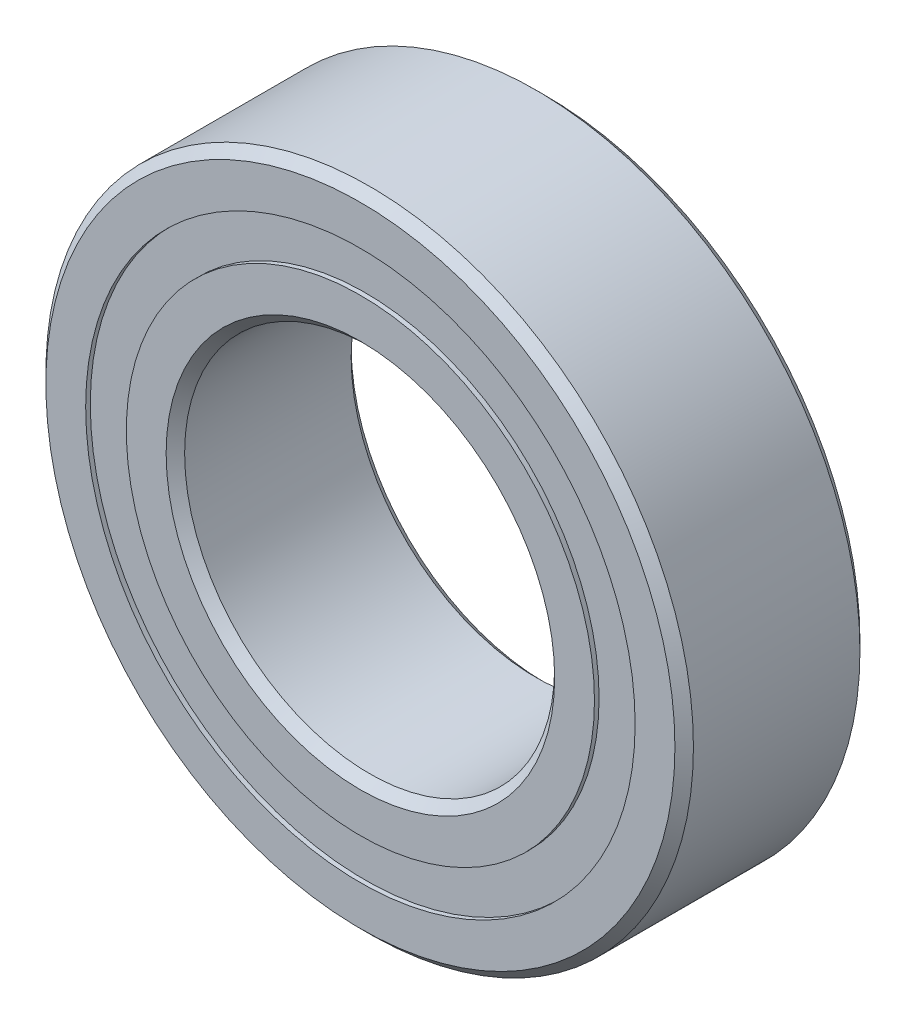
ISO-10303-21;
HEADER;
FILE_DESCRIPTION(('STEP AP214'),'2;1');
FILE_NAME('part.step','',(''),(''),'','','');
FILE_SCHEMA(('AUTOMOTIVE_DESIGN { 1 0 10303 214 1 1 1 1 }'));
ENDSEC;
DATA;
#1=APPLICATION_CONTEXT('core data for automotive mechanical design processes');
#2=APPLICATION_PROTOCOL_DEFINITION('international standard','automotive_design',2000,#1);
#3=PRODUCT_CONTEXT('',#1,'mechanical');
#4=PRODUCT('Part','Part','',(#3));
#5=PRODUCT_RELATED_PRODUCT_CATEGORY('part','',(#4));
#6=PRODUCT_DEFINITION_FORMATION('','',#4);
#7=PRODUCT_DEFINITION_CONTEXT('part definition',#1,'design');
#8=PRODUCT_DEFINITION('design','',#6,#7);
#9=PRODUCT_DEFINITION_SHAPE('','',#8);
#10=(LENGTH_UNIT() NAMED_UNIT(*) SI_UNIT(.MILLI.,.METRE.));
#11=(NAMED_UNIT(*) PLANE_ANGLE_UNIT() SI_UNIT($,.RADIAN.));
#12=(NAMED_UNIT(*) SI_UNIT($,.STERADIAN.) SOLID_ANGLE_UNIT());
#13=UNCERTAINTY_MEASURE_WITH_UNIT(LENGTH_MEASURE(1.E-05),#10,'distance_accuracy_value','');
#14=(GEOMETRIC_REPRESENTATION_CONTEXT(3) GLOBAL_UNCERTAINTY_ASSIGNED_CONTEXT((#13)) GLOBAL_UNIT_ASSIGNED_CONTEXT((#10,
#11,#12)) REPRESENTATION_CONTEXT('',''));
#15=CARTESIAN_POINT('',(0.,0.,0.));
#16=DIRECTION('',(0.,0.,1.));
#17=DIRECTION('',(1.,0.,0.));
#18=AXIS2_PLACEMENT_3D('',#15,#16,#17);
#19=CARTESIAN_POINT('',(0.,5.93956043956044,-1.9));
#20=DIRECTION('',(0.,0.,1.));
#21=DIRECTION('',(1.,0.,0.));
#22=AXIS2_PLACEMENT_3D('',#19,#20,#21);
#23=PLANE('',#22);
#24=CARTESIAN_POINT('',(0.,0.,-1.9));
#25=DIRECTION('',(0.,0.,1.));
#26=DIRECTION('',(1.,0.,0.));
#27=AXIS2_PLACEMENT_3D('',#24,#25,#26);
#28=CIRCLE('',#27,5.93956043956044);
#29=CARTESIAN_POINT('',(5.93956043956044,0.,-1.9));
#30=VERTEX_POINT('',#29);
#31=EDGE_CURVE('E64',#30,#30,#28,.T.);
#32=ORIENTED_EDGE('',*,*,#31,.F.);
#33=EDGE_LOOP('',(#32));
#34=FACE_BOUND('',#33,.T.);
#35=CARTESIAN_POINT('',(0.,0.,-1.9));
#36=DIRECTION('',(0.,0.,1.));
#37=DIRECTION('',(1.,0.,0.));
#38=AXIS2_PLACEMENT_3D('',#35,#36,#37);
#39=CIRCLE('',#38,5.06043956043956);
#40=CARTESIAN_POINT('',(5.06043956043956,0.,-1.9));
#41=VERTEX_POINT('',#40);
#42=EDGE_CURVE('E11',#41,#41,#39,.T.);
#43=ORIENTED_EDGE('',*,*,#42,.T.);
#44=EDGE_LOOP('',(#43));
#45=FACE_BOUND('',#44,.T.);
#46=ADVANCED_FACE('F50',(#34,#45),#23,.F.);
#47=CARTESIAN_POINT('',(0.,0.,2.));
#48=DIRECTION('',(0.,0.,1.));
#49=DIRECTION('',(1.,0.,0.));
#50=AXIS2_PLACEMENT_3D('',#47,#48,#49);
#51=CYLINDRICAL_SURFACE('',#50,5.06043956043956);
#52=ORIENTED_EDGE('',*,*,#42,.F.);
#53=EDGE_LOOP('',(#52));
#54=FACE_BOUND('',#53,.T.);
#55=CARTESIAN_POINT('',(0.,0.,-0.991633418565898));
#56=DIRECTION('',(0.,0.,1.));
#57=DIRECTION('',(1.,0.,0.));
#58=AXIS2_PLACEMENT_3D('',#55,#56,#57);
#59=CIRCLE('',#58,5.06043956043956);
#60=CARTESIAN_POINT('',(5.06043956043956,0.,-0.991633418565898));
#61=VERTEX_POINT('',#60);
#62=EDGE_CURVE('E56',#61,#61,#59,.T.);
#63=ORIENTED_EDGE('',*,*,#62,.T.);
#64=EDGE_LOOP('',(#63));
#65=FACE_BOUND('',#64,.T.);
#66=ADVANCED_FACE('F73',(#54,#65),#51,.F.);
#67=CARTESIAN_POINT('',(0.,5.93956043956044,-0.991633418565898));
#68=DIRECTION('',(0.,0.,-1.));
#69=DIRECTION('',(-1.,0.,0.));
#70=AXIS2_PLACEMENT_3D('',#67,#68,#69);
#71=PLANE('',#70);
#72=ORIENTED_EDGE('',*,*,#62,.F.);
#73=EDGE_LOOP('',(#72));
#74=FACE_BOUND('',#73,.T.);
#75=CARTESIAN_POINT('',(0.,0.,-0.991633418565898));
#76=DIRECTION('',(0.,0.,1.));
#77=DIRECTION('',(1.,0.,0.));
#78=AXIS2_PLACEMENT_3D('',#75,#76,#77);
#79=CIRCLE('',#78,5.93956043956044);
#80=CARTESIAN_POINT('',(5.93956043956044,0.,-0.991633418565898));
#81=VERTEX_POINT('',#80);
#82=EDGE_CURVE('E60',#81,#81,#79,.T.);
#83=ORIENTED_EDGE('',*,*,#82,.T.);
#84=EDGE_LOOP('',(#83));
#85=FACE_BOUND('',#84,.T.);
#86=ADVANCED_FACE('F77',(#74,#85),#71,.F.);
#87=CARTESIAN_POINT('',(0.,0.,2.));
#88=DIRECTION('',(0.,0.,1.));
#89=DIRECTION('',(1.,0.,0.));
#90=AXIS2_PLACEMENT_3D('',#87,#88,#89);
#91=CYLINDRICAL_SURFACE('',#90,5.93956043956044);
#92=ORIENTED_EDGE('',*,*,#82,.F.);
#93=EDGE_LOOP('',(#92));
#94=FACE_BOUND('',#93,.T.);
#95=ORIENTED_EDGE('',*,*,#31,.T.);
#96=EDGE_LOOP('',(#95));
#97=FACE_BOUND('',#96,.T.);
#98=ADVANCED_FACE('F70',(#94,#97),#91,.T.);
#99=CLOSED_SHELL('',(#46,#66,#86,#98));
#100=MANIFOLD_SOLID_BREP('B2',#99);
#101=CARTESIAN_POINT('',(0.,5.93956043956044,1.9));
#102=DIRECTION('',(0.,0.,-1.));
#103=DIRECTION('',(-1.,0.,0.));
#104=AXIS2_PLACEMENT_3D('',#101,#102,#103);
#105=PLANE('',#104);
#106=CARTESIAN_POINT('',(0.,0.,1.9));
#107=DIRECTION('',(0.,0.,1.));
#108=DIRECTION('',(1.,0.,0.));
#109=AXIS2_PLACEMENT_3D('',#106,#107,#108);
#110=CIRCLE('',#109,5.06043956043956);
#111=CARTESIAN_POINT('',(5.06043956043956,0.,1.9));
#112=VERTEX_POINT('',#111);
#113=EDGE_CURVE('E49',#112,#112,#110,.T.);
#114=ORIENTED_EDGE('',*,*,#113,.F.);
#115=EDGE_LOOP('',(#114));
#116=FACE_BOUND('',#115,.T.);
#117=CARTESIAN_POINT('',(0.,0.,1.9));
#118=DIRECTION('',(0.,0.,1.));
#119=DIRECTION('',(1.,0.,0.));
#120=AXIS2_PLACEMENT_3D('',#117,#118,#119);
#121=CIRCLE('',#120,5.93956043956044);
#122=CARTESIAN_POINT('',(5.93956043956044,0.,1.9));
#123=VERTEX_POINT('',#122);
#124=EDGE_CURVE('E124',#123,#123,#121,.T.);
#125=ORIENTED_EDGE('',*,*,#124,.T.);
#126=EDGE_LOOP('',(#125));
#127=FACE_BOUND('',#126,.T.);
#128=ADVANCED_FACE('F110',(#116,#127),#105,.F.);
#129=CARTESIAN_POINT('',(0.,0.,2.));
#130=DIRECTION('',(0.,0.,1.));
#131=DIRECTION('',(1.,0.,0.));
#132=AXIS2_PLACEMENT_3D('',#129,#130,#131);
#133=CYLINDRICAL_SURFACE('',#132,5.06043956043956);
#134=CARTESIAN_POINT('',(0.,0.,0.991633418565898));
#135=DIRECTION('',(0.,0.,1.));
#136=DIRECTION('',(1.,0.,0.));
#137=AXIS2_PLACEMENT_3D('',#134,#135,#136);
#138=CIRCLE('',#137,5.06043956043956);
#139=CARTESIAN_POINT('',(5.06043956043956,0.,0.991633418565898));
#140=VERTEX_POINT('',#139);
#141=EDGE_CURVE('E116',#140,#140,#138,.T.);
#142=ORIENTED_EDGE('',*,*,#141,.F.);
#143=EDGE_LOOP('',(#142));
#144=FACE_BOUND('',#143,.T.);
#145=ORIENTED_EDGE('',*,*,#113,.T.);
#146=EDGE_LOOP('',(#145));
#147=FACE_BOUND('',#146,.T.);
#148=ADVANCED_FACE('F139',(#144,#147),#133,.F.);
#149=CARTESIAN_POINT('',(0.,5.93956043956044,0.991633418565898));
#150=DIRECTION('',(0.,0.,1.));
#151=DIRECTION('',(1.,0.,0.));
#152=AXIS2_PLACEMENT_3D('',#149,#150,#151);
#153=PLANE('',#152);
#154=CARTESIAN_POINT('',(0.,0.,0.991633418565898));
#155=DIRECTION('',(0.,0.,1.));
#156=DIRECTION('',(1.,0.,0.));
#157=AXIS2_PLACEMENT_3D('',#154,#155,#156);
#158=CIRCLE('',#157,5.93956043956044);
#159=CARTESIAN_POINT('',(5.93956043956044,0.,0.991633418565898));
#160=VERTEX_POINT('',#159);
#161=EDGE_CURVE('E120',#160,#160,#158,.T.);
#162=ORIENTED_EDGE('',*,*,#161,.F.);
#163=EDGE_LOOP('',(#162));
#164=FACE_BOUND('',#163,.T.);
#165=ORIENTED_EDGE('',*,*,#141,.T.);
#166=EDGE_LOOP('',(#165));
#167=FACE_BOUND('',#166,.T.);
#168=ADVANCED_FACE('F134',(#164,#167),#153,.F.);
#169=CARTESIAN_POINT('',(0.,0.,2.));
#170=DIRECTION('',(0.,0.,1.));
#171=DIRECTION('',(1.,0.,0.));
#172=AXIS2_PLACEMENT_3D('',#169,#170,#171);
#173=CYLINDRICAL_SURFACE('',#172,5.93956043956044);
#174=ORIENTED_EDGE('',*,*,#124,.F.);
#175=EDGE_LOOP('',(#174));
#176=FACE_BOUND('',#175,.T.);
#177=ORIENTED_EDGE('',*,*,#161,.T.);
#178=EDGE_LOOP('',(#177));
#179=FACE_BOUND('',#178,.T.);
#180=ADVANCED_FACE('F131',(#176,#179),#173,.T.);
#181=CLOSED_SHELL('',(#128,#148,#168,#180));
#182=MANIFOLD_SOLID_BREP('B6',#181);
#183=CARTESIAN_POINT('',(-2.74999999999994,4.76313972081445,0.));
#184=DIRECTION('',(0.,0.,1.));
#185=DIRECTION('',(-0.499999999999989,0.866025403784445,0.));
#186=AXIS2_PLACEMENT_3D('',#183,#184,#185);
#187=SPHERICAL_SURFACE('',#186,0.991633418565898);
#188=CARTESIAN_POINT('',(-2.74999999999994,4.76313972081445,0.991633418565898));
#189=VERTEX_POINT('',#188);
#190=VERTEX_LOOP('',#189);
#191=FACE_BOUND('',#190,.T.);
#192=ADVANCED_FACE('F170',(#191),#187,.T.);
#193=CLOSED_SHELL('',(#192));
#194=MANIFOLD_SOLID_BREP('B44',#193);
#195=CARTESIAN_POINT('',(-4.76313972081438,2.75000000000006,0.));
#196=DIRECTION('',(0.,0.,1.));
#197=DIRECTION('',(-0.866025403784433,0.50000000000001,0.));
#198=AXIS2_PLACEMENT_3D('',#195,#196,#197);
#199=SPHERICAL_SURFACE('',#198,0.991633418565898);
#200=CARTESIAN_POINT('',(-4.76313972081438,2.75000000000006,0.991633418565898));
#201=VERTEX_POINT('',#200);
#202=VERTEX_LOOP('',#201);
#203=FACE_BOUND('',#202,.T.);
#204=ADVANCED_FACE('F193',(#203),#199,.T.);
#205=CLOSED_SHELL('',(#204));
#206=MANIFOLD_SOLID_BREP('B106',#205);
#207=CARTESIAN_POINT('',(-5.5,0.,0.));
#208=DIRECTION('',(0.,0.,1.));
#209=DIRECTION('',(-1.,0.,0.));
#210=AXIS2_PLACEMENT_3D('',#207,#208,#209);
#211=SPHERICAL_SURFACE('',#210,0.991633418565898);
#212=CARTESIAN_POINT('',(-5.5,0.,0.991633418565898));
#213=VERTEX_POINT('',#212);
#214=VERTEX_LOOP('',#213);
#215=FACE_BOUND('',#214,.T.);
#216=ADVANCED_FACE('F216',(#215),#211,.T.);
#217=CLOSED_SHELL('',(#216));
#218=MANIFOLD_SOLID_BREP('B166',#217);
#219=CARTESIAN_POINT('',(-4.76313972081444,-2.74999999999996,0.));
#220=DIRECTION('',(0.,0.,1.));
#221=DIRECTION('',(-0.866025403784443,-0.499999999999992,0.));
#222=AXIS2_PLACEMENT_3D('',#219,#220,#221);
#223=SPHERICAL_SURFACE('',#222,0.991633418565898);
#224=CARTESIAN_POINT('',(-4.76313972081444,-2.74999999999996,0.991633418565898));
#225=VERTEX_POINT('',#224);
#226=VERTEX_LOOP('',#225);
#227=FACE_BOUND('',#226,.T.);
#228=ADVANCED_FACE('F239',(#227),#223,.T.);
#229=CLOSED_SHELL('',(#228));
#230=MANIFOLD_SOLID_BREP('B189',#229);
#231=CARTESIAN_POINT('',(-2.75000000000004,-4.76313972081439,0.));
#232=DIRECTION('',(0.,0.,1.));
#233=DIRECTION('',(-0.500000000000007,-0.866025403784435,0.));
#234=AXIS2_PLACEMENT_3D('',#231,#232,#233);
#235=SPHERICAL_SURFACE('',#234,0.991633418565898);
#236=CARTESIAN_POINT('',(-2.75000000000004,-4.76313972081439,0.991633418565898));
#237=VERTEX_POINT('',#236);
#238=VERTEX_LOOP('',#237);
#239=FACE_BOUND('',#238,.T.);
#240=ADVANCED_FACE('F262',(#239),#235,.T.);
#241=CLOSED_SHELL('',(#240));
#242=MANIFOLD_SOLID_BREP('B212',#241);
#243=CARTESIAN_POINT('',(0.,-5.5,0.));
#244=DIRECTION('',(0.,0.,1.));
#245=DIRECTION('',(0.,-1.,0.));
#246=AXIS2_PLACEMENT_3D('',#243,#244,#245);
#247=SPHERICAL_SURFACE('',#246,0.991633418565898);
#248=CARTESIAN_POINT('',(0.,-5.5,0.991633418565898));
#249=VERTEX_POINT('',#248);
#250=VERTEX_LOOP('',#249);
#251=FACE_BOUND('',#250,.T.);
#252=ADVANCED_FACE('F285',(#251),#247,.T.);
#253=CLOSED_SHELL('',(#252));
#254=MANIFOLD_SOLID_BREP('B235',#253);
#255=CARTESIAN_POINT('',(2.74999999999997,-4.76313972081443,0.));
#256=DIRECTION('',(0.,0.,1.));
#257=DIRECTION('',(0.499999999999995,-0.866025403784442,0.));
#258=AXIS2_PLACEMENT_3D('',#255,#256,#257);
#259=SPHERICAL_SURFACE('',#258,0.991633418565898);
#260=CARTESIAN_POINT('',(2.74999999999997,-4.76313972081443,0.991633418565898));
#261=VERTEX_POINT('',#260);
#262=VERTEX_LOOP('',#261);
#263=FACE_BOUND('',#262,.T.);
#264=ADVANCED_FACE('F308',(#263),#259,.T.);
#265=CLOSED_SHELL('',(#264));
#266=MANIFOLD_SOLID_BREP('B258',#265);
#267=CARTESIAN_POINT('',(4.7631397208144,-2.75000000000002,0.));
#268=DIRECTION('',(0.,0.,1.));
#269=DIRECTION('',(0.866025403784436,-0.500000000000004,0.));
#270=AXIS2_PLACEMENT_3D('',#267,#268,#269);
#271=SPHERICAL_SURFACE('',#270,0.991633418565898);
#272=CARTESIAN_POINT('',(4.7631397208144,-2.75000000000002,0.991633418565898));
#273=VERTEX_POINT('',#272);
#274=VERTEX_LOOP('',#273);
#275=FACE_BOUND('',#274,.T.);
#276=ADVANCED_FACE('F331',(#275),#271,.T.);
#277=CLOSED_SHELL('',(#276));
#278=MANIFOLD_SOLID_BREP('B281',#277);
#279=CARTESIAN_POINT('',(5.5,0.,0.));
#280=DIRECTION('',(0.,0.,1.));
#281=DIRECTION('',(1.,0.,0.));
#282=AXIS2_PLACEMENT_3D('',#279,#280,#281);
#283=SPHERICAL_SURFACE('',#282,0.991633418565898);
#284=CARTESIAN_POINT('',(5.5,0.,0.991633418565898));
#285=VERTEX_POINT('',#284);
#286=VERTEX_LOOP('',#285);
#287=FACE_BOUND('',#286,.T.);
#288=ADVANCED_FACE('F354',(#287),#283,.T.);
#289=CLOSED_SHELL('',(#288));
#290=MANIFOLD_SOLID_BREP('B304',#289);
#291=CARTESIAN_POINT('',(4.76313972081442,2.74999999999999,0.));
#292=DIRECTION('',(0.,0.,1.));
#293=DIRECTION('',(0.86602540378444,0.499999999999998,0.));
#294=AXIS2_PLACEMENT_3D('',#291,#292,#293);
#295=SPHERICAL_SURFACE('',#294,0.991633418565898);
#296=CARTESIAN_POINT('',(4.76313972081442,2.74999999999999,0.991633418565898));
#297=VERTEX_POINT('',#296);
#298=VERTEX_LOOP('',#297);
#299=FACE_BOUND('',#298,.T.);
#300=ADVANCED_FACE('F377',(#299),#295,.T.);
#301=CLOSED_SHELL('',(#300));
#302=MANIFOLD_SOLID_BREP('B327',#301);
#303=CARTESIAN_POINT('',(2.75000000000001,4.76313972081441,0.));
#304=DIRECTION('',(0.,0.,1.));
#305=DIRECTION('',(0.500000000000001,0.866025403784438,0.));
#306=AXIS2_PLACEMENT_3D('',#303,#304,#305);
#307=SPHERICAL_SURFACE('',#306,0.991633418565898);
#308=CARTESIAN_POINT('',(2.75000000000001,4.76313972081441,0.991633418565898));
#309=VERTEX_POINT('',#308);
#310=VERTEX_LOOP('',#309);
#311=FACE_BOUND('',#310,.T.);
#312=ADVANCED_FACE('F400',(#311),#307,.T.);
#313=CLOSED_SHELL('',(#312));
#314=MANIFOLD_SOLID_BREP('B350',#313);
#315=CARTESIAN_POINT('',(0.,5.5,0.));
#316=DIRECTION('',(0.,0.,1.));
#317=DIRECTION('',(0.,1.,0.));
#318=AXIS2_PLACEMENT_3D('',#315,#316,#317);
#319=SPHERICAL_SURFACE('',#318,0.991633418565898);
#320=CARTESIAN_POINT('',(0.,5.5,0.991633418565898));
#321=VERTEX_POINT('',#320);
#322=VERTEX_LOOP('',#321);
#323=FACE_BOUND('',#322,.T.);
#324=ADVANCED_FACE('F425',(#323),#319,.T.);
#325=CLOSED_SHELL('',(#324));
#326=MANIFOLD_SOLID_BREP('B373',#325);
#327=CARTESIAN_POINT('',(0.,5.06043956043956,2.));
#328=DIRECTION('',(0.,0.,-1.));
#329=DIRECTION('',(-1.,0.,0.));
#330=AXIS2_PLACEMENT_3D('',#327,#328,#329);
#331=PLANE('',#330);
#332=CARTESIAN_POINT('',(0.,0.,2.));
#333=DIRECTION('',(0.,0.,1.));
#334=DIRECTION('',(1.,0.,0.));
#335=AXIS2_PLACEMENT_3D('',#332,#333,#334);
#336=CIRCLE('',#335,4.2);
#337=CARTESIAN_POINT('',(4.2,0.,2.));
#338=VERTEX_POINT('',#337);
#339=EDGE_CURVE('E471',#338,#338,#336,.T.);
#340=ORIENTED_EDGE('',*,*,#339,.F.);
#341=EDGE_LOOP('',(#340));
#342=FACE_BOUND('',#341,.T.);
#343=CARTESIAN_POINT('',(0.,0.,2.));
#344=DIRECTION('',(0.,0.,1.));
#345=DIRECTION('',(1.,0.,0.));
#346=AXIS2_PLACEMENT_3D('',#343,#344,#345);
#347=CIRCLE('',#346,5.06043956043956);
#348=CARTESIAN_POINT('',(5.06043956043956,0.,2.));
#349=VERTEX_POINT('',#348);
#350=EDGE_CURVE('E424',#349,#349,#347,.T.);
#351=ORIENTED_EDGE('',*,*,#350,.T.);
#352=EDGE_LOOP('',(#351));
#353=FACE_BOUND('',#352,.T.);
#354=ADVANCED_FACE('F443',(#342,#353),#331,.F.);
#355=CARTESIAN_POINT('',(0.,0.,2.));
#356=DIRECTION('',(0.,0.,1.));
#357=DIRECTION('',(1.,0.,0.));
#358=AXIS2_PLACEMENT_3D('',#355,#356,#357);
#359=CYLINDRICAL_SURFACE('',#358,5.06043956043956);
#360=ORIENTED_EDGE('',*,*,#350,.F.);
#361=EDGE_LOOP('',(#360));
#362=FACE_BOUND('',#361,.T.);
#363=CARTESIAN_POINT('',(0.,0.,0.888888888888889));
#364=DIRECTION('',(0.,0.,1.));
#365=DIRECTION('',(1.,0.,0.));
#366=AXIS2_PLACEMENT_3D('',#363,#364,#365);
#367=CIRCLE('',#366,5.06043956043956);
#368=CARTESIAN_POINT('',(5.06043956043956,0.,0.888888888888889));
#369=VERTEX_POINT('',#368);
#370=EDGE_CURVE('E449',#369,#369,#367,.T.);
#371=ORIENTED_EDGE('',*,*,#370,.T.);
#372=EDGE_LOOP('',(#371));
#373=FACE_BOUND('',#372,.T.);
#374=ADVANCED_FACE('F478',(#362,#373),#359,.T.);
#375=CARTESIAN_POINT('',(0.,0.,0.));
#376=DIRECTION('',(0.,0.,1.));
#377=DIRECTION('',(1.,0.,0.));
#378=AXIS2_PLACEMENT_3D('',#375,#376,#377);
#379=TOROIDAL_SURFACE('',#378,5.5,0.991633418565897);
#380=ORIENTED_EDGE('',*,*,#370,.F.);
#381=EDGE_LOOP('',(#380));
#382=FACE_BOUND('',#381,.T.);
#383=CARTESIAN_POINT('',(0.,0.,-0.88888888888889));
#384=DIRECTION('',(0.,0.,1.));
#385=DIRECTION('',(1.,0.,0.));
#386=AXIS2_PLACEMENT_3D('',#383,#384,#385);
#387=CIRCLE('',#386,5.06043956043956);
#388=CARTESIAN_POINT('',(5.06043956043956,0.,-0.88888888888889));
#389=VERTEX_POINT('',#388);
#390=EDGE_CURVE('E453',#389,#389,#387,.T.);
#391=ORIENTED_EDGE('',*,*,#390,.T.);
#392=EDGE_LOOP('',(#391));
#393=FACE_BOUND('',#392,.T.);
#394=ADVANCED_FACE('F482',(#382,#393),#379,.F.);
#395=CARTESIAN_POINT('',(0.,0.,2.));
#396=DIRECTION('',(0.,0.,1.));
#397=DIRECTION('',(1.,0.,0.));
#398=AXIS2_PLACEMENT_3D('',#395,#396,#397);
#399=CYLINDRICAL_SURFACE('',#398,5.06043956043956);
#400=ORIENTED_EDGE('',*,*,#390,.F.);
#401=EDGE_LOOP('',(#400));
#402=FACE_BOUND('',#401,.T.);
#403=CARTESIAN_POINT('',(0.,0.,-2.));
#404=DIRECTION('',(0.,0.,1.));
#405=DIRECTION('',(1.,0.,0.));
#406=AXIS2_PLACEMENT_3D('',#403,#404,#405);
#407=CIRCLE('',#406,5.06043956043956);
#408=CARTESIAN_POINT('',(5.06043956043956,0.,-2.));
#409=VERTEX_POINT('',#408);
#410=EDGE_CURVE('E457',#409,#409,#407,.T.);
#411=ORIENTED_EDGE('',*,*,#410,.T.);
#412=EDGE_LOOP('',(#411));
#413=FACE_BOUND('',#412,.T.);
#414=ADVANCED_FACE('F487',(#402,#413),#399,.T.);
#415=CARTESIAN_POINT('',(0.,4.2,-2.));
#416=DIRECTION('',(0.,0.,1.));
#417=DIRECTION('',(1.,0.,0.));
#418=AXIS2_PLACEMENT_3D('',#415,#416,#417);
#419=PLANE('',#418);
#420=ORIENTED_EDGE('',*,*,#410,.F.);
#421=EDGE_LOOP('',(#420));
#422=FACE_BOUND('',#421,.T.);
#423=CARTESIAN_POINT('',(0.,0.,-2.));
#424=DIRECTION('',(0.,0.,1.));
#425=DIRECTION('',(1.,0.,0.));
#426=AXIS2_PLACEMENT_3D('',#423,#424,#425);
#427=CIRCLE('',#426,4.2);
#428=CARTESIAN_POINT('',(4.2,0.,-2.));
#429=VERTEX_POINT('',#428);
#430=EDGE_CURVE('E462',#429,#429,#427,.T.);
#431=ORIENTED_EDGE('',*,*,#430,.T.);
#432=EDGE_LOOP('',(#431));
#433=FACE_BOUND('',#432,.T.);
#434=ADVANCED_FACE('F493',(#422,#433),#419,.F.);
#435=CARTESIAN_POINT('',(0.,0.,-1.8));
#436=DIRECTION('',(0.,0.,-1.));
#437=DIRECTION('',(-1.,0.,0.));
#438=AXIS2_PLACEMENT_3D('',#435,#436,#437);
#439=CONICAL_SURFACE('',#438,4.,0.785398163397446);
#440=ORIENTED_EDGE('',*,*,#430,.F.);
#441=EDGE_LOOP('',(#440));
#442=FACE_BOUND('',#441,.T.);
#443=CARTESIAN_POINT('',(0.,0.,-1.8));
#444=DIRECTION('',(0.,0.,1.));
#445=DIRECTION('',(1.,0.,0.));
#446=AXIS2_PLACEMENT_3D('',#443,#444,#445);
#447=CIRCLE('',#446,4.);
#448=CARTESIAN_POINT('',(4.,0.,-1.8));
#449=VERTEX_POINT('',#448);
#450=EDGE_CURVE('E465',#449,#449,#447,.T.);
#451=ORIENTED_EDGE('',*,*,#450,.T.);
#452=EDGE_LOOP('',(#451));
#453=FACE_BOUND('',#452,.T.);
#454=ADVANCED_FACE('F497',(#442,#453),#439,.F.);
#455=CARTESIAN_POINT('',(0.,0.,2.));
#456=DIRECTION('',(0.,0.,1.));
#457=DIRECTION('',(1.,0.,0.));
#458=AXIS2_PLACEMENT_3D('',#455,#456,#457);
#459=CYLINDRICAL_SURFACE('',#458,4.);
#460=ORIENTED_EDGE('',*,*,#450,.F.);
#461=EDGE_LOOP('',(#460));
#462=FACE_BOUND('',#461,.T.);
#463=CARTESIAN_POINT('',(0.,0.,1.8));
#464=DIRECTION('',(0.,0.,1.));
#465=DIRECTION('',(1.,0.,0.));
#466=AXIS2_PLACEMENT_3D('',#463,#464,#465);
#467=CIRCLE('',#466,4.);
#468=CARTESIAN_POINT('',(4.,0.,1.8));
#469=VERTEX_POINT('',#468);
#470=EDGE_CURVE('E468',#469,#469,#467,.T.);
#471=ORIENTED_EDGE('',*,*,#470,.T.);
#472=EDGE_LOOP('',(#471));
#473=FACE_BOUND('',#472,.T.);
#474=ADVANCED_FACE('F501',(#462,#473),#459,.F.);
#475=CARTESIAN_POINT('',(0.,0.,2.));
#476=DIRECTION('',(0.,0.,1.));
#477=DIRECTION('',(1.,0.,0.));
#478=AXIS2_PLACEMENT_3D('',#475,#476,#477);
#479=CONICAL_SURFACE('',#478,4.2,0.785398163397449);
#480=ORIENTED_EDGE('',*,*,#470,.F.);
#481=EDGE_LOOP('',(#480));
#482=FACE_BOUND('',#481,.T.);
#483=ORIENTED_EDGE('',*,*,#339,.T.);
#484=EDGE_LOOP('',(#483));
#485=FACE_BOUND('',#484,.T.);
#486=ADVANCED_FACE('F475',(#482,#485),#479,.F.);
#487=CLOSED_SHELL('',(#354,#374,#394,#414,#434,#454,#474,#486));
#488=MANIFOLD_SOLID_BREP('B396',#487);
#489=CARTESIAN_POINT('',(0.,0.,1.8));
#490=DIRECTION('',(0.,0.,-1.));
#491=DIRECTION('',(-1.,0.,0.));
#492=AXIS2_PLACEMENT_3D('',#489,#490,#491);
#493=CONICAL_SURFACE('',#492,7.,0.785398163397445);
#494=CARTESIAN_POINT('',(0.,0.,2.));
#495=DIRECTION('',(0.,0.,1.));
#496=DIRECTION('',(1.,0.,0.));
#497=AXIS2_PLACEMENT_3D('',#494,#495,#496);
#498=CIRCLE('',#497,6.8);
#499=CARTESIAN_POINT('',(6.8,0.,2.));
#500=VERTEX_POINT('',#499);
#501=EDGE_CURVE('E577',#500,#500,#498,.T.);
#502=ORIENTED_EDGE('',*,*,#501,.F.);
#503=EDGE_LOOP('',(#502));
#504=FACE_BOUND('',#503,.T.);
#505=CARTESIAN_POINT('',(0.,0.,1.8));
#506=DIRECTION('',(0.,0.,1.));
#507=DIRECTION('',(1.,0.,0.));
#508=AXIS2_PLACEMENT_3D('',#505,#506,#507);
#509=CIRCLE('',#508,7.);
#510=CARTESIAN_POINT('',(7.,0.,1.8));
#511=VERTEX_POINT('',#510);
#512=EDGE_CURVE('E442',#511,#511,#509,.T.);
#513=ORIENTED_EDGE('',*,*,#512,.T.);
#514=EDGE_LOOP('',(#513));
#515=FACE_BOUND('',#514,.T.);
#516=ADVANCED_FACE('F549',(#504,#515),#493,.T.);
#517=CARTESIAN_POINT('',(0.,0.,2.));
#518=DIRECTION('',(0.,0.,1.));
#519=DIRECTION('',(1.,0.,0.));
#520=AXIS2_PLACEMENT_3D('',#517,#518,#519);
#521=CYLINDRICAL_SURFACE('',#520,7.);
#522=ORIENTED_EDGE('',*,*,#512,.F.);
#523=EDGE_LOOP('',(#522));
#524=FACE_BOUND('',#523,.T.);
#525=CARTESIAN_POINT('',(0.,0.,-1.8));
#526=DIRECTION('',(0.,0.,1.));
#527=DIRECTION('',(1.,0.,0.));
#528=AXIS2_PLACEMENT_3D('',#525,#526,#527);
#529=CIRCLE('',#528,7.);
#530=CARTESIAN_POINT('',(7.,0.,-1.8));
#531=VERTEX_POINT('',#530);
#532=EDGE_CURVE('E555',#531,#531,#529,.T.);
#533=ORIENTED_EDGE('',*,*,#532,.T.);
#534=EDGE_LOOP('',(#533));
#535=FACE_BOUND('',#534,.T.);
#536=ADVANCED_FACE('F584',(#524,#535),#521,.T.);
#537=CARTESIAN_POINT('',(0.,0.,-2.));
#538=DIRECTION('',(0.,0.,1.));
#539=DIRECTION('',(1.,0.,0.));
#540=AXIS2_PLACEMENT_3D('',#537,#538,#539);
#541=CONICAL_SURFACE('',#540,6.8,0.785398163397446);
#542=ORIENTED_EDGE('',*,*,#532,.F.);
#543=EDGE_LOOP('',(#542));
#544=FACE_BOUND('',#543,.T.);
#545=CARTESIAN_POINT('',(0.,0.,-2.));
#546=DIRECTION('',(0.,0.,1.));
#547=DIRECTION('',(1.,0.,0.));
#548=AXIS2_PLACEMENT_3D('',#545,#546,#547);
#549=CIRCLE('',#548,6.8);
#550=CARTESIAN_POINT('',(6.8,0.,-2.));
#551=VERTEX_POINT('',#550);
#552=EDGE_CURVE('E559',#551,#551,#549,.T.);
#553=ORIENTED_EDGE('',*,*,#552,.T.);
#554=EDGE_LOOP('',(#553));
#555=FACE_BOUND('',#554,.T.);
#556=ADVANCED_FACE('F588',(#544,#555),#541,.T.);
#557=CARTESIAN_POINT('',(0.,6.8,-2.));
#558=DIRECTION('',(0.,0.,1.));
#559=DIRECTION('',(1.,0.,0.));
#560=AXIS2_PLACEMENT_3D('',#557,#558,#559);
#561=PLANE('',#560);
#562=ORIENTED_EDGE('',*,*,#552,.F.);
#563=EDGE_LOOP('',(#562));
#564=FACE_BOUND('',#563,.T.);
#565=CARTESIAN_POINT('',(0.,0.,-2.));
#566=DIRECTION('',(0.,0.,1.));
#567=DIRECTION('',(1.,0.,0.));
#568=AXIS2_PLACEMENT_3D('',#565,#566,#567);
#569=CIRCLE('',#568,5.93956043956044);
#570=CARTESIAN_POINT('',(5.93956043956044,0.,-2.));
#571=VERTEX_POINT('',#570);
#572=EDGE_CURVE('E563',#571,#571,#569,.T.);
#573=ORIENTED_EDGE('',*,*,#572,.T.);
#574=EDGE_LOOP('',(#573));
#575=FACE_BOUND('',#574,.T.);
#576=ADVANCED_FACE('F593',(#564,#575),#561,.F.);
#577=CARTESIAN_POINT('',(0.,0.,2.));
#578=DIRECTION('',(0.,0.,1.));
#579=DIRECTION('',(1.,0.,0.));
#580=AXIS2_PLACEMENT_3D('',#577,#578,#579);
#581=CYLINDRICAL_SURFACE('',#580,5.93956043956044);
#582=ORIENTED_EDGE('',*,*,#572,.F.);
#583=EDGE_LOOP('',(#582));
#584=FACE_BOUND('',#583,.T.);
#585=CARTESIAN_POINT('',(0.,0.,-0.888888888888889));
#586=DIRECTION('',(0.,0.,1.));
#587=DIRECTION('',(1.,0.,0.));
#588=AXIS2_PLACEMENT_3D('',#585,#586,#587);
#589=CIRCLE('',#588,5.93956043956044);
#590=CARTESIAN_POINT('',(5.93956043956044,0.,-0.888888888888889));
#591=VERTEX_POINT('',#590);
#592=EDGE_CURVE('E568',#591,#591,#589,.T.);
#593=ORIENTED_EDGE('',*,*,#592,.T.);
#594=EDGE_LOOP('',(#593));
#595=FACE_BOUND('',#594,.T.);
#596=ADVANCED_FACE('F599',(#584,#595),#581,.F.);
#597=CARTESIAN_POINT('',(0.,0.,0.));
#598=DIRECTION('',(0.,0.,1.));
#599=DIRECTION('',(1.,0.,0.));
#600=AXIS2_PLACEMENT_3D('',#597,#598,#599);
#601=TOROIDAL_SURFACE('',#600,5.5,0.991633418565898);
#602=ORIENTED_EDGE('',*,*,#592,.F.);
#603=EDGE_LOOP('',(#602));
#604=FACE_BOUND('',#603,.T.);
#605=CARTESIAN_POINT('',(0.,0.,0.888888888888889));
#606=DIRECTION('',(0.,0.,1.));
#607=DIRECTION('',(1.,0.,0.));
#608=AXIS2_PLACEMENT_3D('',#605,#606,#607);
#609=CIRCLE('',#608,5.93956043956044);
#610=CARTESIAN_POINT('',(5.93956043956044,0.,0.888888888888889));
#611=VERTEX_POINT('',#610);
#612=EDGE_CURVE('E571',#611,#611,#609,.T.);
#613=ORIENTED_EDGE('',*,*,#612,.T.);
#614=EDGE_LOOP('',(#613));
#615=FACE_BOUND('',#614,.T.);
#616=ADVANCED_FACE('F603',(#604,#615),#601,.F.);
#617=CARTESIAN_POINT('',(0.,0.,2.));
#618=DIRECTION('',(0.,0.,1.));
#619=DIRECTION('',(1.,0.,0.));
#620=AXIS2_PLACEMENT_3D('',#617,#618,#619);
#621=CYLINDRICAL_SURFACE('',#620,5.93956043956044);
#622=ORIENTED_EDGE('',*,*,#612,.F.);
#623=EDGE_LOOP('',(#622));
#624=FACE_BOUND('',#623,.T.);
#625=CARTESIAN_POINT('',(0.,0.,2.));
#626=DIRECTION('',(0.,0.,1.));
#627=DIRECTION('',(1.,0.,0.));
#628=AXIS2_PLACEMENT_3D('',#625,#626,#627);
#629=CIRCLE('',#628,5.93956043956044);
#630=CARTESIAN_POINT('',(5.93956043956044,0.,2.));
#631=VERTEX_POINT('',#630);
#632=EDGE_CURVE('E574',#631,#631,#629,.T.);
#633=ORIENTED_EDGE('',*,*,#632,.T.);
#634=EDGE_LOOP('',(#633));
#635=FACE_BOUND('',#634,.T.);
#636=ADVANCED_FACE('F607',(#624,#635),#621,.F.);
#637=CARTESIAN_POINT('',(0.,6.8,2.));
#638=DIRECTION('',(0.,0.,-1.));
#639=DIRECTION('',(-1.,0.,0.));
#640=AXIS2_PLACEMENT_3D('',#637,#638,#639);
#641=PLANE('',#640);
#642=ORIENTED_EDGE('',*,*,#632,.F.);
#643=EDGE_LOOP('',(#642));
#644=FACE_BOUND('',#643,.T.);
#645=ORIENTED_EDGE('',*,*,#501,.T.);
#646=EDGE_LOOP('',(#645));
#647=FACE_BOUND('',#646,.T.);
#648=ADVANCED_FACE('F581',(#644,#647),#641,.F.);
#649=CLOSED_SHELL('',(#516,#536,#556,#576,#596,#616,#636,#648));
#650=MANIFOLD_SOLID_BREP('B419',#649);
#651=ADVANCED_BREP_SHAPE_REPRESENTATION('',(#18,#100,#182,#194,#206,#218,#230,#242,#254,#266,
#278,#290,#302,#314,#326,#488,#650),#14);
#652=SHAPE_DEFINITION_REPRESENTATION(#9,#651);
ENDSEC;
END-ISO-10303-21;
